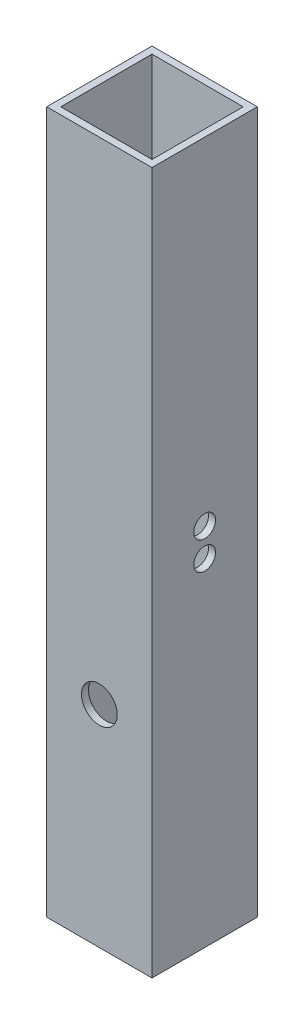
ISO-10303-21;
HEADER;
FILE_DESCRIPTION(('STEP AP214'),'2;1');
FILE_NAME('part.step','',(''),(''),'','','');
FILE_SCHEMA(('AUTOMOTIVE_DESIGN { 1 0 10303 214 1 1 1 1 }'));
ENDSEC;
DATA;
#1=APPLICATION_CONTEXT('core data for automotive mechanical design processes');
#2=APPLICATION_PROTOCOL_DEFINITION('international standard','automotive_design',2000,#1);
#3=PRODUCT_CONTEXT('',#1,'mechanical');
#4=PRODUCT('Part','Part','',(#3));
#5=PRODUCT_RELATED_PRODUCT_CATEGORY('part','',(#4));
#6=PRODUCT_DEFINITION_FORMATION('','',#4);
#7=PRODUCT_DEFINITION_CONTEXT('part definition',#1,'design');
#8=PRODUCT_DEFINITION('design','',#6,#7);
#9=PRODUCT_DEFINITION_SHAPE('','',#8);
#10=(LENGTH_UNIT() NAMED_UNIT(*) SI_UNIT(.MILLI.,.METRE.));
#11=(NAMED_UNIT(*) PLANE_ANGLE_UNIT() SI_UNIT($,.RADIAN.));
#12=(NAMED_UNIT(*) SI_UNIT($,.STERADIAN.) SOLID_ANGLE_UNIT());
#13=UNCERTAINTY_MEASURE_WITH_UNIT(LENGTH_MEASURE(1.E-05),#10,'distance_accuracy_value','');
#14=(GEOMETRIC_REPRESENTATION_CONTEXT(3) GLOBAL_UNCERTAINTY_ASSIGNED_CONTEXT((#13)) GLOBAL_UNIT_ASSIGNED_CONTEXT((#10,
#11,#12)) REPRESENTATION_CONTEXT('',''));
#15=CARTESIAN_POINT('',(0.,0.,0.));
#16=DIRECTION('',(0.,0.,1.));
#17=DIRECTION('',(1.,0.,0.));
#18=AXIS2_PLACEMENT_3D('',#15,#16,#17);
#19=CARTESIAN_POINT('',(0.,100.,0.));
#20=DIRECTION('',(0.,-1.,0.));
#21=DIRECTION('',(0.,0.,-1.));
#22=AXIS2_PLACEMENT_3D('',#19,#20,#21);
#23=PLANE('',#22);
#24=DIRECTION('',(0.,0.,1.));
#25=VECTOR('',#24,1.);
#26=CARTESIAN_POINT('',(-7.5,100.,-7.5));
#27=LINE('',#26,#25);
#28=CARTESIAN_POINT('',(-7.5,100.,-7.5));
#29=VERTEX_POINT('',#28);
#30=CARTESIAN_POINT('',(-7.5,100.,7.5));
#31=VERTEX_POINT('',#30);
#32=EDGE_CURVE('E158',#29,#31,#27,.T.);
#33=ORIENTED_EDGE('',*,*,#32,.T.);
#34=DIRECTION('',(1.,0.,0.));
#35=VECTOR('',#34,1.);
#36=CARTESIAN_POINT('',(7.5,100.,7.5));
#37=LINE('',#36,#35);
#38=CARTESIAN_POINT('',(7.5,100.,7.5));
#39=VERTEX_POINT('',#38);
#40=EDGE_CURVE('E162',#31,#39,#37,.T.);
#41=ORIENTED_EDGE('',*,*,#40,.T.);
#42=DIRECTION('',(0.,0.,-1.));
#43=VECTOR('',#42,1.);
#44=CARTESIAN_POINT('',(7.5,100.,-7.5));
#45=LINE('',#44,#43);
#46=CARTESIAN_POINT('',(7.5,100.,-7.5));
#47=VERTEX_POINT('',#46);
#48=EDGE_CURVE('E166',#39,#47,#45,.T.);
#49=ORIENTED_EDGE('',*,*,#48,.T.);
#50=DIRECTION('',(-1.,0.,0.));
#51=VECTOR('',#50,1.);
#52=CARTESIAN_POINT('',(7.5,100.,-7.5));
#53=LINE('',#52,#51);
#54=EDGE_CURVE('E169',#47,#29,#53,.T.);
#55=ORIENTED_EDGE('',*,*,#54,.T.);
#56=EDGE_LOOP('',(#33,#41,#49,#55));
#57=FACE_BOUND('',#56,.T.);
#58=DIRECTION('',(0.,0.,1.));
#59=VECTOR('',#58,1.);
#60=CARTESIAN_POINT('',(-6.49999999999999,100.,6.49999999999998));
#61=LINE('',#60,#59);
#62=CARTESIAN_POINT('',(-6.49999999999999,100.,-6.5));
#63=VERTEX_POINT('',#62);
#64=CARTESIAN_POINT('',(-6.49999999999999,100.,6.49999999999998));
#65=VERTEX_POINT('',#64);
#66=EDGE_CURVE('E108',#63,#65,#61,.T.);
#67=ORIENTED_EDGE('',*,*,#66,.F.);
#68=DIRECTION('',(-1.,0.,0.));
#69=VECTOR('',#68,1.);
#70=CARTESIAN_POINT('',(-6.49999999999999,100.,-6.5));
#71=LINE('',#70,#69);
#72=CARTESIAN_POINT('',(6.5,100.,-6.5));
#73=VERTEX_POINT('',#72);
#74=EDGE_CURVE('E134',#73,#63,#71,.T.);
#75=ORIENTED_EDGE('',*,*,#74,.F.);
#76=DIRECTION('',(0.,0.,-1.));
#77=VECTOR('',#76,1.);
#78=CARTESIAN_POINT('',(6.5,100.,-6.5));
#79=LINE('',#78,#77);
#80=CARTESIAN_POINT('',(6.5,100.,6.49999999999998));
#81=VERTEX_POINT('',#80);
#82=EDGE_CURVE('E130',#81,#73,#79,.T.);
#83=ORIENTED_EDGE('',*,*,#82,.F.);
#84=DIRECTION('',(1.,0.,0.));
#85=VECTOR('',#84,1.);
#86=CARTESIAN_POINT('',(6.5,100.,6.49999999999998));
#87=LINE('',#86,#85);
#88=EDGE_CURVE('E117',#65,#81,#87,.T.);
#89=ORIENTED_EDGE('',*,*,#88,.F.);
#90=EDGE_LOOP('',(#67,#75,#83,#89));
#91=FACE_BOUND('',#90,.T.);
#92=ADVANCED_FACE('F40',(#57,#91),#23,.F.);
#93=CARTESIAN_POINT('',(0.,0.,0.));
#94=DIRECTION('',(0.,-1.,0.));
#95=DIRECTION('',(0.,0.,-1.));
#96=AXIS2_PLACEMENT_3D('',#93,#94,#95);
#97=PLANE('',#96);
#98=DIRECTION('',(0.,0.,1.));
#99=VECTOR('',#98,1.);
#100=CARTESIAN_POINT('',(-7.5,0.,-7.5));
#101=LINE('',#100,#99);
#102=CARTESIAN_POINT('',(-7.5,0.,-7.5));
#103=VERTEX_POINT('',#102);
#104=CARTESIAN_POINT('',(-7.5,0.,7.5));
#105=VERTEX_POINT('',#104);
#106=EDGE_CURVE('E126',#103,#105,#101,.T.);
#107=ORIENTED_EDGE('',*,*,#106,.F.);
#108=DIRECTION('',(-1.,0.,0.));
#109=VECTOR('',#108,1.);
#110=CARTESIAN_POINT('',(7.5,0.,-7.5));
#111=LINE('',#110,#109);
#112=CARTESIAN_POINT('',(7.5,0.,-7.5));
#113=VERTEX_POINT('',#112);
#114=EDGE_CURVE('E163',#113,#103,#111,.T.);
#115=ORIENTED_EDGE('',*,*,#114,.F.);
#116=DIRECTION('',(0.,0.,-1.));
#117=VECTOR('',#116,1.);
#118=CARTESIAN_POINT('',(7.5,0.,-7.5));
#119=LINE('',#118,#117);
#120=CARTESIAN_POINT('',(7.5,0.,7.5));
#121=VERTEX_POINT('',#120);
#122=EDGE_CURVE('E179',#121,#113,#119,.T.);
#123=ORIENTED_EDGE('',*,*,#122,.F.);
#124=DIRECTION('',(1.,0.,0.));
#125=VECTOR('',#124,1.);
#126=CARTESIAN_POINT('',(7.5,0.,7.5));
#127=LINE('',#126,#125);
#128=EDGE_CURVE('E176',#105,#121,#127,.T.);
#129=ORIENTED_EDGE('',*,*,#128,.F.);
#130=EDGE_LOOP('',(#107,#115,#123,#129));
#131=FACE_BOUND('',#130,.T.);
#132=DIRECTION('',(-1.,0.,0.));
#133=VECTOR('',#132,1.);
#134=CARTESIAN_POINT('',(-6.49999999999999,0.,-6.5));
#135=LINE('',#134,#133);
#136=CARTESIAN_POINT('',(6.5,0.,-6.5));
#137=VERTEX_POINT('',#136);
#138=CARTESIAN_POINT('',(-6.49999999999999,0.,-6.5));
#139=VERTEX_POINT('',#138);
#140=EDGE_CURVE('E118',#137,#139,#135,.T.);
#141=ORIENTED_EDGE('',*,*,#140,.T.);
#142=DIRECTION('',(0.,0.,1.));
#143=VECTOR('',#142,1.);
#144=CARTESIAN_POINT('',(-6.49999999999999,0.,6.49999999999998));
#145=LINE('',#144,#143);
#146=CARTESIAN_POINT('',(-6.49999999999999,0.,6.49999999999998));
#147=VERTEX_POINT('',#146);
#148=EDGE_CURVE('E66',#139,#147,#145,.T.);
#149=ORIENTED_EDGE('',*,*,#148,.T.);
#150=DIRECTION('',(1.,0.,0.));
#151=VECTOR('',#150,1.);
#152=CARTESIAN_POINT('',(6.5,0.,6.49999999999998));
#153=LINE('',#152,#151);
#154=CARTESIAN_POINT('',(6.5,0.,6.49999999999998));
#155=VERTEX_POINT('',#154);
#156=EDGE_CURVE('E124',#147,#155,#153,.T.);
#157=ORIENTED_EDGE('',*,*,#156,.T.);
#158=DIRECTION('',(0.,0.,-1.));
#159=VECTOR('',#158,1.);
#160=CARTESIAN_POINT('',(6.5,0.,-6.5));
#161=LINE('',#160,#159);
#162=EDGE_CURVE('E145',#155,#137,#161,.T.);
#163=ORIENTED_EDGE('',*,*,#162,.T.);
#164=EDGE_LOOP('',(#141,#149,#157,#163));
#165=FACE_BOUND('',#164,.T.);
#166=ADVANCED_FACE('F261',(#131,#165),#97,.T.);
#167=CARTESIAN_POINT('',(-7.5,100.,-7.5));
#168=DIRECTION('',(1.,0.,0.));
#169=DIRECTION('',(0.,0.,-1.));
#170=AXIS2_PLACEMENT_3D('',#167,#168,#169);
#171=PLANE('',#170);
#172=CARTESIAN_POINT('',(-7.5,52.,0.));
#173=DIRECTION('',(1.,0.,0.));
#174=DIRECTION('',(0.,0.,-1.));
#175=AXIS2_PLACEMENT_3D('',#172,#173,#174);
#176=CIRCLE('',#175,1.55);
#177=CARTESIAN_POINT('',(-7.5,52.,-1.55));
#178=VERTEX_POINT('',#177);
#179=EDGE_CURVE('E203',#178,#178,#176,.F.);
#180=ORIENTED_EDGE('',*,*,#179,.F.);
#181=EDGE_LOOP('',(#180));
#182=FACE_BOUND('',#181,.T.);
#183=CARTESIAN_POINT('',(-7.5,48.,0.));
#184=DIRECTION('',(1.,0.,0.));
#185=DIRECTION('',(0.,0.,-1.));
#186=AXIS2_PLACEMENT_3D('',#183,#184,#185);
#187=CIRCLE('',#186,1.55);
#188=CARTESIAN_POINT('',(-7.5,48.,-1.55));
#189=VERTEX_POINT('',#188);
#190=EDGE_CURVE('E217',#189,#189,#187,.F.);
#191=ORIENTED_EDGE('',*,*,#190,.F.);
#192=EDGE_LOOP('',(#191));
#193=FACE_BOUND('',#192,.T.);
#194=ORIENTED_EDGE('',*,*,#106,.T.);
#195=DIRECTION('',(0.,-1.,0.));
#196=VECTOR('',#195,1.);
#197=CARTESIAN_POINT('',(-7.5,100.,7.5));
#198=LINE('',#197,#196);
#199=EDGE_CURVE('E11',#31,#105,#198,.T.);
#200=ORIENTED_EDGE('',*,*,#199,.F.);
#201=ORIENTED_EDGE('',*,*,#32,.F.);
#202=DIRECTION('',(0.,-1.,0.));
#203=VECTOR('',#202,1.);
#204=CARTESIAN_POINT('',(-7.5,100.,-7.5));
#205=LINE('',#204,#203);
#206=EDGE_CURVE('E172',#29,#103,#205,.T.);
#207=ORIENTED_EDGE('',*,*,#206,.T.);
#208=EDGE_LOOP('',(#194,#200,#201,#207));
#209=FACE_BOUND('',#208,.T.);
#210=ADVANCED_FACE('F42',(#182,#193,#209),#171,.F.);
#211=CARTESIAN_POINT('',(7.5,100.,7.5));
#212=DIRECTION('',(0.,0.,-1.));
#213=DIRECTION('',(-1.,0.,0.));
#214=AXIS2_PLACEMENT_3D('',#211,#212,#213);
#215=PLANE('',#214);
#216=CARTESIAN_POINT('',(0.,30.,7.5));
#217=DIRECTION('',(0.,0.,1.));
#218=DIRECTION('',(1.,0.,0.));
#219=AXIS2_PLACEMENT_3D('',#216,#217,#218);
#220=CIRCLE('',#219,2.55);
#221=CARTESIAN_POINT('',(2.55,30.,7.5));
#222=VERTEX_POINT('',#221);
#223=EDGE_CURVE('E198',#222,#222,#220,.T.);
#224=ORIENTED_EDGE('',*,*,#223,.F.);
#225=EDGE_LOOP('',(#224));
#226=FACE_BOUND('',#225,.T.);
#227=ORIENTED_EDGE('',*,*,#128,.T.);
#228=DIRECTION('',(0.,-1.,0.));
#229=VECTOR('',#228,1.);
#230=CARTESIAN_POINT('',(7.5,100.,7.5));
#231=LINE('',#230,#229);
#232=EDGE_CURVE('E50',#39,#121,#231,.T.);
#233=ORIENTED_EDGE('',*,*,#232,.F.);
#234=ORIENTED_EDGE('',*,*,#40,.F.);
#235=ORIENTED_EDGE('',*,*,#199,.T.);
#236=EDGE_LOOP('',(#227,#233,#234,#235));
#237=FACE_BOUND('',#236,.T.);
#238=ADVANCED_FACE('F276',(#226,#237),#215,.F.);
#239=CARTESIAN_POINT('',(7.5,100.,-7.5));
#240=DIRECTION('',(-1.,0.,0.));
#241=DIRECTION('',(0.,0.,1.));
#242=AXIS2_PLACEMENT_3D('',#239,#240,#241);
#243=PLANE('',#242);
#244=CARTESIAN_POINT('',(7.5,52.,0.));
#245=DIRECTION('',(1.,0.,0.));
#246=DIRECTION('',(0.,0.,-1.));
#247=AXIS2_PLACEMENT_3D('',#244,#245,#246);
#248=CIRCLE('',#247,1.55);
#249=CARTESIAN_POINT('',(7.5,52.,-1.55));
#250=VERTEX_POINT('',#249);
#251=EDGE_CURVE('E211',#250,#250,#248,.T.);
#252=ORIENTED_EDGE('',*,*,#251,.F.);
#253=EDGE_LOOP('',(#252));
#254=FACE_BOUND('',#253,.T.);
#255=CARTESIAN_POINT('',(7.5,48.,0.));
#256=DIRECTION('',(1.,0.,0.));
#257=DIRECTION('',(0.,0.,-1.));
#258=AXIS2_PLACEMENT_3D('',#255,#256,#257);
#259=CIRCLE('',#258,1.55);
#260=CARTESIAN_POINT('',(7.5,48.,-1.55));
#261=VERTEX_POINT('',#260);
#262=EDGE_CURVE('E220',#261,#261,#259,.T.);
#263=ORIENTED_EDGE('',*,*,#262,.F.);
#264=EDGE_LOOP('',(#263));
#265=FACE_BOUND('',#264,.T.);
#266=ORIENTED_EDGE('',*,*,#122,.T.);
#267=DIRECTION('',(0.,-1.,0.));
#268=VECTOR('',#267,1.);
#269=CARTESIAN_POINT('',(7.5,100.,-7.5));
#270=LINE('',#269,#268);
#271=EDGE_CURVE('E187',#47,#113,#270,.T.);
#272=ORIENTED_EDGE('',*,*,#271,.F.);
#273=ORIENTED_EDGE('',*,*,#48,.F.);
#274=ORIENTED_EDGE('',*,*,#232,.T.);
#275=EDGE_LOOP('',(#266,#272,#273,#274));
#276=FACE_BOUND('',#275,.T.);
#277=ADVANCED_FACE('F274',(#254,#265,#276),#243,.F.);
#278=CARTESIAN_POINT('',(7.5,100.,-7.5));
#279=DIRECTION('',(0.,0.,1.));
#280=DIRECTION('',(1.,0.,0.));
#281=AXIS2_PLACEMENT_3D('',#278,#279,#280);
#282=PLANE('',#281);
#283=CARTESIAN_POINT('',(0.,30.,-7.50000000000001));
#284=DIRECTION('',(0.,0.,1.));
#285=DIRECTION('',(1.,0.,0.));
#286=AXIS2_PLACEMENT_3D('',#283,#284,#285);
#287=CIRCLE('',#286,2.55);
#288=CARTESIAN_POINT('',(2.55,30.,-7.50000000000001));
#289=VERTEX_POINT('',#288);
#290=EDGE_CURVE('E142',#289,#289,#287,.T.);
#291=ORIENTED_EDGE('',*,*,#290,.T.);
#292=EDGE_LOOP('',(#291));
#293=FACE_BOUND('',#292,.T.);
#294=ORIENTED_EDGE('',*,*,#114,.T.);
#295=ORIENTED_EDGE('',*,*,#206,.F.);
#296=ORIENTED_EDGE('',*,*,#54,.F.);
#297=ORIENTED_EDGE('',*,*,#271,.T.);
#298=EDGE_LOOP('',(#294,#295,#296,#297));
#299=FACE_BOUND('',#298,.T.);
#300=ADVANCED_FACE('F240',(#293,#299),#282,.F.);
#301=CARTESIAN_POINT('',(-6.49999999999999,100.,6.49999999999998));
#302=DIRECTION('',(1.,0.,0.));
#303=DIRECTION('',(0.,0.,-1.));
#304=AXIS2_PLACEMENT_3D('',#301,#302,#303);
#305=PLANE('',#304);
#306=CARTESIAN_POINT('',(-6.49999999999999,52.,0.));
#307=DIRECTION('',(1.,0.,0.));
#308=DIRECTION('',(0.,0.,-1.));
#309=AXIS2_PLACEMENT_3D('',#306,#307,#308);
#310=CIRCLE('',#309,1.55);
#311=CARTESIAN_POINT('',(-6.49999999999999,52.,-1.55));
#312=VERTEX_POINT('',#311);
#313=EDGE_CURVE('E227',#312,#312,#310,.T.);
#314=ORIENTED_EDGE('',*,*,#313,.F.);
#315=EDGE_LOOP('',(#314));
#316=FACE_BOUND('',#315,.T.);
#317=CARTESIAN_POINT('',(-6.49999999999999,48.,0.));
#318=DIRECTION('',(1.,0.,0.));
#319=DIRECTION('',(0.,0.,-1.));
#320=AXIS2_PLACEMENT_3D('',#317,#318,#319);
#321=CIRCLE('',#320,1.55);
#322=CARTESIAN_POINT('',(-6.49999999999999,48.,-1.55));
#323=VERTEX_POINT('',#322);
#324=EDGE_CURVE('E202',#323,#323,#321,.T.);
#325=ORIENTED_EDGE('',*,*,#324,.F.);
#326=EDGE_LOOP('',(#325));
#327=FACE_BOUND('',#326,.T.);
#328=ORIENTED_EDGE('',*,*,#148,.F.);
#329=DIRECTION('',(0.,-1.,0.));
#330=VECTOR('',#329,1.);
#331=CARTESIAN_POINT('',(-6.49999999999999,100.,-6.5));
#332=LINE('',#331,#330);
#333=EDGE_CURVE('E112',#63,#139,#332,.T.);
#334=ORIENTED_EDGE('',*,*,#333,.F.);
#335=ORIENTED_EDGE('',*,*,#66,.T.);
#336=DIRECTION('',(0.,-1.,0.));
#337=VECTOR('',#336,1.);
#338=CARTESIAN_POINT('',(-6.49999999999999,100.,6.49999999999998));
#339=LINE('',#338,#337);
#340=EDGE_CURVE('E111',#65,#147,#339,.T.);
#341=ORIENTED_EDGE('',*,*,#340,.T.);
#342=EDGE_LOOP('',(#328,#334,#335,#341));
#343=FACE_BOUND('',#342,.T.);
#344=ADVANCED_FACE('F110',(#316,#327,#343),#305,.T.);
#345=CARTESIAN_POINT('',(6.5,100.,6.49999999999998));
#346=DIRECTION('',(0.,0.,-1.));
#347=DIRECTION('',(-1.,0.,0.));
#348=AXIS2_PLACEMENT_3D('',#345,#346,#347);
#349=PLANE('',#348);
#350=CARTESIAN_POINT('',(0.,30.,6.49999999999998));
#351=DIRECTION('',(0.,0.,-1.));
#352=DIRECTION('',(-1.,0.,0.));
#353=AXIS2_PLACEMENT_3D('',#350,#351,#352);
#354=CIRCLE('',#353,2.55);
#355=CARTESIAN_POINT('',(-2.55,30.,6.49999999999998));
#356=VERTEX_POINT('',#355);
#357=EDGE_CURVE('E197',#356,#356,#354,.T.);
#358=ORIENTED_EDGE('',*,*,#357,.F.);
#359=EDGE_LOOP('',(#358));
#360=FACE_BOUND('',#359,.T.);
#361=ORIENTED_EDGE('',*,*,#156,.F.);
#362=ORIENTED_EDGE('',*,*,#340,.F.);
#363=ORIENTED_EDGE('',*,*,#88,.T.);
#364=DIRECTION('',(0.,-1.,0.));
#365=VECTOR('',#364,1.);
#366=CARTESIAN_POINT('',(6.5,100.,6.49999999999998));
#367=LINE('',#366,#365);
#368=EDGE_CURVE('E127',#81,#155,#367,.T.);
#369=ORIENTED_EDGE('',*,*,#368,.T.);
#370=EDGE_LOOP('',(#361,#362,#363,#369));
#371=FACE_BOUND('',#370,.T.);
#372=ADVANCED_FACE('F121',(#360,#371),#349,.T.);
#373=CARTESIAN_POINT('',(6.5,100.,-6.5));
#374=DIRECTION('',(-1.,0.,0.));
#375=DIRECTION('',(0.,0.,1.));
#376=AXIS2_PLACEMENT_3D('',#373,#374,#375);
#377=PLANE('',#376);
#378=CARTESIAN_POINT('',(6.5,52.,0.));
#379=DIRECTION('',(-1.,0.,0.));
#380=DIRECTION('',(0.,0.,1.));
#381=AXIS2_PLACEMENT_3D('',#378,#379,#380);
#382=CIRCLE('',#381,1.55);
#383=CARTESIAN_POINT('',(6.5,52.,1.55));
#384=VERTEX_POINT('',#383);
#385=EDGE_CURVE('E44',#384,#384,#382,.T.);
#386=ORIENTED_EDGE('',*,*,#385,.F.);
#387=EDGE_LOOP('',(#386));
#388=FACE_BOUND('',#387,.T.);
#389=CARTESIAN_POINT('',(6.5,48.,0.));
#390=DIRECTION('',(-1.,0.,0.));
#391=DIRECTION('',(0.,0.,1.));
#392=AXIS2_PLACEMENT_3D('',#389,#390,#391);
#393=CIRCLE('',#392,1.55);
#394=CARTESIAN_POINT('',(6.5,48.,1.55));
#395=VERTEX_POINT('',#394);
#396=EDGE_CURVE('E199',#395,#395,#393,.T.);
#397=ORIENTED_EDGE('',*,*,#396,.F.);
#398=EDGE_LOOP('',(#397));
#399=FACE_BOUND('',#398,.T.);
#400=ORIENTED_EDGE('',*,*,#162,.F.);
#401=ORIENTED_EDGE('',*,*,#368,.F.);
#402=ORIENTED_EDGE('',*,*,#82,.T.);
#403=DIRECTION('',(0.,-1.,0.));
#404=VECTOR('',#403,1.);
#405=CARTESIAN_POINT('',(6.5,100.,-6.5));
#406=LINE('',#405,#404);
#407=EDGE_CURVE('E58',#73,#137,#406,.T.);
#408=ORIENTED_EDGE('',*,*,#407,.T.);
#409=EDGE_LOOP('',(#400,#401,#402,#408));
#410=FACE_BOUND('',#409,.T.);
#411=ADVANCED_FACE('F256',(#388,#399,#410),#377,.T.);
#412=CARTESIAN_POINT('',(-6.49999999999999,100.,-6.5));
#413=DIRECTION('',(0.,0.,1.));
#414=DIRECTION('',(1.,0.,0.));
#415=AXIS2_PLACEMENT_3D('',#412,#413,#414);
#416=PLANE('',#415);
#417=CARTESIAN_POINT('',(0.,30.,-6.50000000000001));
#418=DIRECTION('',(0.,0.,1.));
#419=DIRECTION('',(1.,0.,0.));
#420=AXIS2_PLACEMENT_3D('',#417,#418,#419);
#421=CIRCLE('',#420,2.55);
#422=CARTESIAN_POINT('',(2.55,30.,-6.50000000000001));
#423=VERTEX_POINT('',#422);
#424=EDGE_CURVE('E194',#423,#423,#421,.T.);
#425=ORIENTED_EDGE('',*,*,#424,.F.);
#426=EDGE_LOOP('',(#425));
#427=FACE_BOUND('',#426,.T.);
#428=ORIENTED_EDGE('',*,*,#140,.F.);
#429=ORIENTED_EDGE('',*,*,#407,.F.);
#430=ORIENTED_EDGE('',*,*,#74,.T.);
#431=ORIENTED_EDGE('',*,*,#333,.T.);
#432=EDGE_LOOP('',(#428,#429,#430,#431));
#433=FACE_BOUND('',#432,.T.);
#434=ADVANCED_FACE('F246',(#427,#433),#416,.T.);
#435=CARTESIAN_POINT('',(0.,30.,-92.5));
#436=DIRECTION('',(0.,0.,1.));
#437=DIRECTION('',(1.,0.,0.));
#438=AXIS2_PLACEMENT_3D('',#435,#436,#437);
#439=CYLINDRICAL_SURFACE('',#438,2.55);
#440=ORIENTED_EDGE('',*,*,#424,.T.);
#441=EDGE_LOOP('',(#440));
#442=FACE_BOUND('',#441,.T.);
#443=ORIENTED_EDGE('',*,*,#290,.F.);
#444=EDGE_LOOP('',(#443));
#445=FACE_BOUND('',#444,.T.);
#446=ADVANCED_FACE('F243',(#442,#445),#439,.F.);
#447=ORIENTED_EDGE('',*,*,#357,.T.);
#448=EDGE_LOOP('',(#447));
#449=FACE_BOUND('',#448,.T.);
#450=ORIENTED_EDGE('',*,*,#223,.T.);
#451=EDGE_LOOP('',(#450));
#452=FACE_BOUND('',#451,.T.);
#453=ADVANCED_FACE('F245',(#449,#452),#439,.F.);
#454=CARTESIAN_POINT('',(-11.8840620433566,48.,0.));
#455=DIRECTION('',(1.,0.,0.));
#456=DIRECTION('',(0.,0.,-1.));
#457=AXIS2_PLACEMENT_3D('',#454,#455,#456);
#458=CYLINDRICAL_SURFACE('',#457,1.55);
#459=ORIENTED_EDGE('',*,*,#396,.T.);
#460=EDGE_LOOP('',(#459));
#461=FACE_BOUND('',#460,.T.);
#462=ORIENTED_EDGE('',*,*,#262,.T.);
#463=EDGE_LOOP('',(#462));
#464=FACE_BOUND('',#463,.T.);
#465=ADVANCED_FACE('F253',(#461,#464),#458,.F.);
#466=CARTESIAN_POINT('',(-11.8840620433566,52.,0.));
#467=DIRECTION('',(1.,0.,0.));
#468=DIRECTION('',(0.,0.,-1.));
#469=AXIS2_PLACEMENT_3D('',#466,#467,#468);
#470=CYLINDRICAL_SURFACE('',#469,1.55);
#471=ORIENTED_EDGE('',*,*,#385,.T.);
#472=EDGE_LOOP('',(#471));
#473=FACE_BOUND('',#472,.T.);
#474=ORIENTED_EDGE('',*,*,#251,.T.);
#475=EDGE_LOOP('',(#474));
#476=FACE_BOUND('',#475,.T.);
#477=ADVANCED_FACE('F316',(#473,#476),#470,.F.);
#478=ORIENTED_EDGE('',*,*,#324,.T.);
#479=EDGE_LOOP('',(#478));
#480=FACE_BOUND('',#479,.T.);
#481=ORIENTED_EDGE('',*,*,#190,.T.);
#482=EDGE_LOOP('',(#481));
#483=FACE_BOUND('',#482,.T.);
#484=ADVANCED_FACE('F319',(#480,#483),#458,.F.);
#485=ORIENTED_EDGE('',*,*,#313,.T.);
#486=EDGE_LOOP('',(#485));
#487=FACE_BOUND('',#486,.T.);
#488=ORIENTED_EDGE('',*,*,#179,.T.);
#489=EDGE_LOOP('',(#488));
#490=FACE_BOUND('',#489,.T.);
#491=ADVANCED_FACE('F321',(#487,#490),#470,.F.);
#492=CLOSED_SHELL('',(#92,#166,#210,#238,#277,#300,#344,#372,#411,#434,#446,#453,#465,#477,#484,#491));
#493=MANIFOLD_SOLID_BREP('B2',#492);
#494=ADVANCED_BREP_SHAPE_REPRESENTATION('',(#18,#493),#14);
#495=SHAPE_DEFINITION_REPRESENTATION(#9,#494);
ENDSEC;
END-ISO-10303-21;
